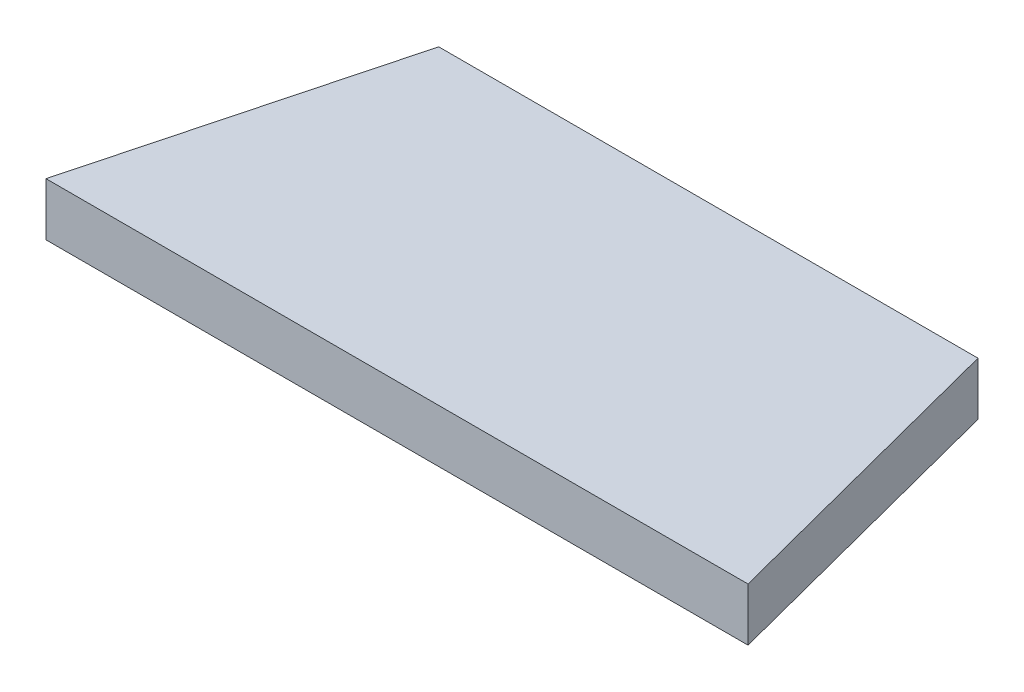
ISO-10303-21;
HEADER;
FILE_DESCRIPTION(('STEP AP214'),'2;1');
FILE_NAME('part.step','',(''),(''),'','','');
FILE_SCHEMA(('AUTOMOTIVE_DESIGN { 1 0 10303 214 1 1 1 1 }'));
ENDSEC;
DATA;
#1=APPLICATION_CONTEXT('core data for automotive mechanical design processes');
#2=APPLICATION_PROTOCOL_DEFINITION('international standard','automotive_design',2000,#1);
#3=PRODUCT_CONTEXT('',#1,'mechanical');
#4=PRODUCT('Part','Part','',(#3));
#5=PRODUCT_RELATED_PRODUCT_CATEGORY('part','',(#4));
#6=PRODUCT_DEFINITION_FORMATION('','',#4);
#7=PRODUCT_DEFINITION_CONTEXT('part definition',#1,'design');
#8=PRODUCT_DEFINITION('design','',#6,#7);
#9=PRODUCT_DEFINITION_SHAPE('','',#8);
#10=(LENGTH_UNIT() NAMED_UNIT(*) SI_UNIT(.MILLI.,.METRE.));
#11=(NAMED_UNIT(*) PLANE_ANGLE_UNIT() SI_UNIT($,.RADIAN.));
#12=(NAMED_UNIT(*) SI_UNIT($,.STERADIAN.) SOLID_ANGLE_UNIT());
#13=UNCERTAINTY_MEASURE_WITH_UNIT(LENGTH_MEASURE(1.E-05),#10,'distance_accuracy_value','');
#14=(GEOMETRIC_REPRESENTATION_CONTEXT(3) GLOBAL_UNCERTAINTY_ASSIGNED_CONTEXT((#13)) GLOBAL_UNIT_ASSIGNED_CONTEXT((#10,
#11,#12)) REPRESENTATION_CONTEXT('',''));
#15=CARTESIAN_POINT('',(0.,0.,0.));
#16=DIRECTION('',(0.,0.,1.));
#17=DIRECTION('',(1.,0.,0.));
#18=AXIS2_PLACEMENT_3D('',#15,#16,#17);
#19=CARTESIAN_POINT('',(60.6771871744927,5.,-1.70077827370274));
#20=DIRECTION('',(0.,0.,1.));
#21=DIRECTION('',(1.,0.,0.));
#22=AXIS2_PLACEMENT_3D('',#19,#20,#21);
#23=PLANE('',#22);
#24=DIRECTION('',(-1.,0.,0.));
#25=VECTOR('',#24,1.);
#26=CARTESIAN_POINT('',(60.6771871744927,0.,-1.70077827370274));
#27=LINE('',#26,#25);
#28=CARTESIAN_POINT('',(60.6771871744927,0.,-1.70077827370274));
#29=VERTEX_POINT('',#28);
#30=CARTESIAN_POINT('',(-5.57742551933628,0.,-1.70077827370275));
#31=VERTEX_POINT('',#30);
#32=EDGE_CURVE('E104',#29,#31,#27,.T.);
#33=ORIENTED_EDGE('',*,*,#32,.F.);
#34=DIRECTION('',(0.,-1.,0.));
#35=VECTOR('',#34,1.);
#36=CARTESIAN_POINT('',(60.6771871744927,5.,-1.70077827370274));
#37=LINE('',#36,#35);
#38=CARTESIAN_POINT('',(60.6771871744927,5.,-1.70077827370274));
#39=VERTEX_POINT('',#38);
#40=EDGE_CURVE('E12',#39,#29,#37,.T.);
#41=ORIENTED_EDGE('',*,*,#40,.F.);
#42=DIRECTION('',(-1.,0.,0.));
#43=VECTOR('',#42,1.);
#44=CARTESIAN_POINT('',(60.6771871744927,5.,-1.70077827370274));
#45=LINE('',#44,#43);
#46=CARTESIAN_POINT('',(-5.57742551933628,5.,-1.70077827370275));
#47=VERTEX_POINT('',#46);
#48=EDGE_CURVE('E98',#39,#47,#45,.T.);
#49=ORIENTED_EDGE('',*,*,#48,.T.);
#50=DIRECTION('',(0.,-1.,0.));
#51=VECTOR('',#50,1.);
#52=CARTESIAN_POINT('',(-5.57742551933628,5.,-1.70077827370275));
#53=LINE('',#52,#51);
#54=EDGE_CURVE('E43',#47,#31,#53,.T.);
#55=ORIENTED_EDGE('',*,*,#54,.T.);
#56=EDGE_LOOP('',(#33,#41,#49,#55));
#57=FACE_BOUND('',#56,.T.);
#58=ADVANCED_FACE('F40',(#57),#23,.T.);
#59=CARTESIAN_POINT('',(53.0713187393855,5.,-31.0085762737027));
#60=DIRECTION('',(0.967936291568814,0.,-0.251195811000129));
#61=DIRECTION('',(-0.251195811000129,0.,-0.967936291568814));
#62=AXIS2_PLACEMENT_3D('',#59,#60,#61);
#63=PLANE('',#62);
#64=DIRECTION('',(0.251195811000129,0.,0.967936291568814));
#65=VECTOR('',#64,1.);
#66=CARTESIAN_POINT('',(53.0713187393855,0.,-31.0085762737027));
#67=LINE('',#66,#65);
#68=CARTESIAN_POINT('',(53.0713187393855,0.,-31.0085762737027));
#69=VERTEX_POINT('',#68);
#70=EDGE_CURVE('E100',#69,#29,#67,.T.);
#71=ORIENTED_EDGE('',*,*,#70,.F.);
#72=DIRECTION('',(0.,-1.,0.));
#73=VECTOR('',#72,1.);
#74=CARTESIAN_POINT('',(53.0713187393855,5.,-31.0085762737027));
#75=LINE('',#74,#73);
#76=CARTESIAN_POINT('',(53.0713187393855,5.,-31.0085762737027));
#77=VERTEX_POINT('',#76);
#78=EDGE_CURVE('E49',#77,#69,#75,.T.);
#79=ORIENTED_EDGE('',*,*,#78,.F.);
#80=DIRECTION('',(0.251195811000129,0.,0.967936291568814));
#81=VECTOR('',#80,1.);
#82=CARTESIAN_POINT('',(53.0713187393855,5.,-31.0085762737027));
#83=LINE('',#82,#81);
#84=EDGE_CURVE('E95',#77,#39,#83,.T.);
#85=ORIENTED_EDGE('',*,*,#84,.T.);
#86=ORIENTED_EDGE('',*,*,#40,.T.);
#87=EDGE_LOOP('',(#71,#79,#85,#86));
#88=FACE_BOUND('',#87,.T.);
#89=ADVANCED_FACE('F114',(#88),#63,.T.);
#90=CARTESIAN_POINT('',(2.17922492987974,5.,-31.0085762737027));
#91=DIRECTION('',(0.,0.,-1.));
#92=DIRECTION('',(-1.,0.,0.));
#93=AXIS2_PLACEMENT_3D('',#90,#91,#92);
#94=PLANE('',#93);
#95=DIRECTION('',(1.,0.,0.));
#96=VECTOR('',#95,1.);
#97=CARTESIAN_POINT('',(2.17922492987974,0.,-31.0085762737027));
#98=LINE('',#97,#96);
#99=CARTESIAN_POINT('',(2.17922492987974,0.,-31.0085762737027));
#100=VERTEX_POINT('',#99);
#101=EDGE_CURVE('E90',#100,#69,#98,.T.);
#102=ORIENTED_EDGE('',*,*,#101,.F.);
#103=DIRECTION('',(0.,-1.,0.));
#104=VECTOR('',#103,1.);
#105=CARTESIAN_POINT('',(2.17922492987974,5.,-31.0085762737027));
#106=LINE('',#105,#104);
#107=CARTESIAN_POINT('',(2.17922492987974,5.,-31.0085762737027));
#108=VERTEX_POINT('',#107);
#109=EDGE_CURVE('E85',#108,#100,#106,.T.);
#110=ORIENTED_EDGE('',*,*,#109,.F.);
#111=DIRECTION('',(1.,0.,0.));
#112=VECTOR('',#111,1.);
#113=CARTESIAN_POINT('',(2.17922492987974,5.,-31.0085762737027));
#114=LINE('',#113,#112);
#115=EDGE_CURVE('E88',#108,#77,#114,.T.);
#116=ORIENTED_EDGE('',*,*,#115,.T.);
#117=ORIENTED_EDGE('',*,*,#78,.T.);
#118=EDGE_LOOP('',(#102,#110,#116,#117));
#119=FACE_BOUND('',#118,.T.);
#120=ADVANCED_FACE('F87',(#119),#94,.T.);
#121=CARTESIAN_POINT('',(-5.57742551933628,5.,-1.70077827370275));
#122=DIRECTION('',(-0.96671580249505,0.,-0.255852608363394));
#123=DIRECTION('',(-0.255852608363394,0.,0.96671580249505));
#124=AXIS2_PLACEMENT_3D('',#121,#122,#123);
#125=PLANE('',#124);
#126=DIRECTION('',(0.255852608363394,0.,-0.96671580249505));
#127=VECTOR('',#126,1.);
#128=CARTESIAN_POINT('',(-5.57742551933628,0.,-1.70077827370275));
#129=LINE('',#128,#127);
#130=EDGE_CURVE('E107',#31,#100,#129,.T.);
#131=ORIENTED_EDGE('',*,*,#130,.F.);
#132=ORIENTED_EDGE('',*,*,#54,.F.);
#133=DIRECTION('',(0.255852608363394,0.,-0.96671580249505));
#134=VECTOR('',#133,1.);
#135=CARTESIAN_POINT('',(-5.57742551933628,5.,-1.70077827370275));
#136=LINE('',#135,#134);
#137=EDGE_CURVE('E94',#47,#108,#136,.T.);
#138=ORIENTED_EDGE('',*,*,#137,.T.);
#139=ORIENTED_EDGE('',*,*,#109,.T.);
#140=EDGE_LOOP('',(#131,#132,#138,#139));
#141=FACE_BOUND('',#140,.T.);
#142=ADVANCED_FACE('F97',(#141),#125,.T.);
#143=CARTESIAN_POINT('',(0.,5.,0.));
#144=DIRECTION('',(0.,1.,0.));
#145=DIRECTION('',(0.,0.,1.));
#146=AXIS2_PLACEMENT_3D('',#143,#144,#145);
#147=PLANE('',#146);
#148=ORIENTED_EDGE('',*,*,#48,.F.);
#149=ORIENTED_EDGE('',*,*,#84,.F.);
#150=ORIENTED_EDGE('',*,*,#115,.F.);
#151=ORIENTED_EDGE('',*,*,#137,.F.);
#152=EDGE_LOOP('',(#148,#149,#150,#151));
#153=FACE_BOUND('',#152,.T.);
#154=ADVANCED_FACE('F93',(#153),#147,.T.);
#155=CARTESIAN_POINT('',(0.,0.,0.));
#156=DIRECTION('',(0.,1.,0.));
#157=DIRECTION('',(0.,0.,1.));
#158=AXIS2_PLACEMENT_3D('',#155,#156,#157);
#159=PLANE('',#158);
#160=ORIENTED_EDGE('',*,*,#32,.T.);
#161=ORIENTED_EDGE('',*,*,#130,.T.);
#162=ORIENTED_EDGE('',*,*,#101,.T.);
#163=ORIENTED_EDGE('',*,*,#70,.T.);
#164=EDGE_LOOP('',(#160,#161,#162,#163));
#165=FACE_BOUND('',#164,.T.);
#166=ADVANCED_FACE('F113',(#165),#159,.F.);
#167=CLOSED_SHELL('',(#58,#89,#120,#142,#154,#166));
#168=MANIFOLD_SOLID_BREP('B2',#167);
#169=ADVANCED_BREP_SHAPE_REPRESENTATION('',(#18,#168),#14);
#170=SHAPE_DEFINITION_REPRESENTATION(#9,#169);
ENDSEC;
END-ISO-10303-21;
